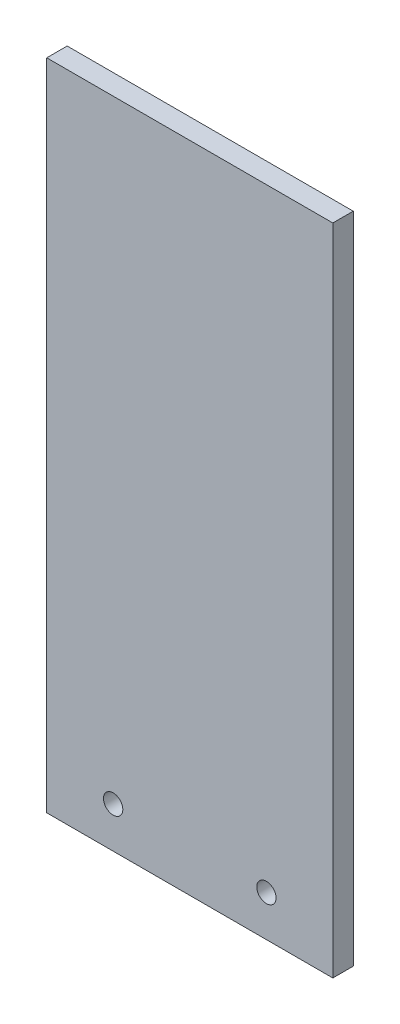
ISO-10303-21;
HEADER;
FILE_DESCRIPTION(('STEP AP214'),'2;1');
FILE_NAME('part.step','',(''),(''),'','','');
FILE_SCHEMA(('AUTOMOTIVE_DESIGN { 1 0 10303 214 1 1 1 1 }'));
ENDSEC;
DATA;
#1=APPLICATION_CONTEXT('core data for automotive mechanical design processes');
#2=APPLICATION_PROTOCOL_DEFINITION('international standard','automotive_design',2000,#1);
#3=PRODUCT_CONTEXT('',#1,'mechanical');
#4=PRODUCT('Part','Part','',(#3));
#5=PRODUCT_RELATED_PRODUCT_CATEGORY('part','',(#4));
#6=PRODUCT_DEFINITION_FORMATION('','',#4);
#7=PRODUCT_DEFINITION_CONTEXT('part definition',#1,'design');
#8=PRODUCT_DEFINITION('design','',#6,#7);
#9=PRODUCT_DEFINITION_SHAPE('','',#8);
#10=(LENGTH_UNIT() NAMED_UNIT(*) SI_UNIT(.MILLI.,.METRE.));
#11=(NAMED_UNIT(*) PLANE_ANGLE_UNIT() SI_UNIT($,.RADIAN.));
#12=(NAMED_UNIT(*) SI_UNIT($,.STERADIAN.) SOLID_ANGLE_UNIT());
#13=UNCERTAINTY_MEASURE_WITH_UNIT(LENGTH_MEASURE(1.E-05),#10,'distance_accuracy_value','');
#14=(GEOMETRIC_REPRESENTATION_CONTEXT(3) GLOBAL_UNCERTAINTY_ASSIGNED_CONTEXT((#13)) GLOBAL_UNIT_ASSIGNED_CONTEXT((#10,
#11,#12)) REPRESENTATION_CONTEXT('',''));
#15=CARTESIAN_POINT('',(0.,0.,0.));
#16=DIRECTION('',(0.,0.,1.));
#17=DIRECTION('',(1.,0.,0.));
#18=AXIS2_PLACEMENT_3D('',#15,#16,#17);
#19=CARTESIAN_POINT('',(0.,203.2,0.));
#20=DIRECTION('',(1.,0.,0.));
#21=DIRECTION('',(0.,0.,-1.));
#22=AXIS2_PLACEMENT_3D('',#19,#20,#21);
#23=PLANE('',#22);
#24=DIRECTION('',(0.,0.,1.));
#25=VECTOR('',#24,1.);
#26=CARTESIAN_POINT('',(0.,0.,0.));
#27=LINE('',#26,#25);
#28=CARTESIAN_POINT('',(0.,0.,-6.35));
#29=VERTEX_POINT('',#28);
#30=CARTESIAN_POINT('',(0.,0.,0.));
#31=VERTEX_POINT('',#30);
#32=EDGE_CURVE('E95',#29,#31,#27,.T.);
#33=ORIENTED_EDGE('',*,*,#32,.T.);
#34=DIRECTION('',(0.,-1.,0.));
#35=VECTOR('',#34,1.);
#36=CARTESIAN_POINT('',(0.,203.2,0.));
#37=LINE('',#36,#35);
#38=CARTESIAN_POINT('',(0.,203.2,0.));
#39=VERTEX_POINT('',#38);
#40=EDGE_CURVE('E11',#39,#31,#37,.T.);
#41=ORIENTED_EDGE('',*,*,#40,.F.);
#42=DIRECTION('',(0.,0.,1.));
#43=VECTOR('',#42,1.);
#44=CARTESIAN_POINT('',(0.,203.2,0.));
#45=LINE('',#44,#43);
#46=CARTESIAN_POINT('',(0.,203.2,-6.35));
#47=VERTEX_POINT('',#46);
#48=EDGE_CURVE('E83',#47,#39,#45,.T.);
#49=ORIENTED_EDGE('',*,*,#48,.F.);
#50=DIRECTION('',(0.,-1.,0.));
#51=VECTOR('',#50,1.);
#52=CARTESIAN_POINT('',(0.,203.2,-6.35));
#53=LINE('',#52,#51);
#54=EDGE_CURVE('E91',#47,#29,#53,.T.);
#55=ORIENTED_EDGE('',*,*,#54,.T.);
#56=EDGE_LOOP('',(#33,#41,#49,#55));
#57=FACE_BOUND('',#56,.T.);
#58=ADVANCED_FACE('F32',(#57),#23,.F.);
#59=CARTESIAN_POINT('',(0.,203.2,0.));
#60=DIRECTION('',(0.,0.,-1.));
#61=DIRECTION('',(-1.,0.,0.));
#62=AXIS2_PLACEMENT_3D('',#59,#60,#61);
#63=PLANE('',#62);
#64=CARTESIAN_POINT('',(20.6375,12.7,0.));
#65=DIRECTION('',(0.,0.,-1.));
#66=DIRECTION('',(-1.,0.,0.));
#67=AXIS2_PLACEMENT_3D('',#64,#65,#66);
#68=CIRCLE('',#67,3.);
#69=CARTESIAN_POINT('',(17.6375,12.7,0.));
#70=VERTEX_POINT('',#69);
#71=EDGE_CURVE('E114',#70,#70,#68,.T.);
#72=ORIENTED_EDGE('',*,*,#71,.T.);
#73=EDGE_LOOP('',(#72));
#74=FACE_BOUND('',#73,.T.);
#75=CARTESIAN_POINT('',(68.2625,12.7,0.));
#76=DIRECTION('',(0.,0.,-1.));
#77=DIRECTION('',(-1.,0.,0.));
#78=AXIS2_PLACEMENT_3D('',#75,#76,#77);
#79=CIRCLE('',#78,3.);
#80=CARTESIAN_POINT('',(65.2625,12.7,0.));
#81=VERTEX_POINT('',#80);
#82=EDGE_CURVE('E98',#81,#81,#79,.T.);
#83=ORIENTED_EDGE('',*,*,#82,.T.);
#84=EDGE_LOOP('',(#83));
#85=FACE_BOUND('',#84,.T.);
#86=DIRECTION('',(1.,0.,0.));
#87=VECTOR('',#86,1.);
#88=CARTESIAN_POINT('',(0.,0.,0.));
#89=LINE('',#88,#87);
#90=CARTESIAN_POINT('',(88.9,0.,0.));
#91=VERTEX_POINT('',#90);
#92=EDGE_CURVE('E87',#31,#91,#89,.T.);
#93=ORIENTED_EDGE('',*,*,#92,.T.);
#94=DIRECTION('',(0.,-1.,0.));
#95=VECTOR('',#94,1.);
#96=CARTESIAN_POINT('',(88.9,203.2,0.));
#97=LINE('',#96,#95);
#98=CARTESIAN_POINT('',(88.9,203.2,0.));
#99=VERTEX_POINT('',#98);
#100=EDGE_CURVE('E40',#99,#91,#97,.T.);
#101=ORIENTED_EDGE('',*,*,#100,.F.);
#102=DIRECTION('',(1.,0.,0.));
#103=VECTOR('',#102,1.);
#104=CARTESIAN_POINT('',(0.,203.2,0.));
#105=LINE('',#104,#103);
#106=EDGE_CURVE('E78',#39,#99,#105,.T.);
#107=ORIENTED_EDGE('',*,*,#106,.F.);
#108=ORIENTED_EDGE('',*,*,#40,.T.);
#109=EDGE_LOOP('',(#93,#101,#107,#108));
#110=FACE_BOUND('',#109,.T.);
#111=ADVANCED_FACE('F86',(#74,#85,#110),#63,.F.);
#112=CARTESIAN_POINT('',(88.9,203.2,0.));
#113=DIRECTION('',(-1.,0.,0.));
#114=DIRECTION('',(0.,0.,1.));
#115=AXIS2_PLACEMENT_3D('',#112,#113,#114);
#116=PLANE('',#115);
#117=DIRECTION('',(0.,0.,-1.));
#118=VECTOR('',#117,1.);
#119=CARTESIAN_POINT('',(88.9,0.,0.));
#120=LINE('',#119,#118);
#121=CARTESIAN_POINT('',(88.9,0.,-6.35));
#122=VERTEX_POINT('',#121);
#123=EDGE_CURVE('E65',#91,#122,#120,.T.);
#124=ORIENTED_EDGE('',*,*,#123,.T.);
#125=DIRECTION('',(0.,-1.,0.));
#126=VECTOR('',#125,1.);
#127=CARTESIAN_POINT('',(88.9,203.2,-6.35));
#128=LINE('',#127,#126);
#129=CARTESIAN_POINT('',(88.9,203.2,-6.35));
#130=VERTEX_POINT('',#129);
#131=EDGE_CURVE('E88',#130,#122,#128,.T.);
#132=ORIENTED_EDGE('',*,*,#131,.F.);
#133=DIRECTION('',(0.,0.,-1.));
#134=VECTOR('',#133,1.);
#135=CARTESIAN_POINT('',(88.9,203.2,0.));
#136=LINE('',#135,#134);
#137=EDGE_CURVE('E81',#99,#130,#136,.T.);
#138=ORIENTED_EDGE('',*,*,#137,.F.);
#139=ORIENTED_EDGE('',*,*,#100,.T.);
#140=EDGE_LOOP('',(#124,#132,#138,#139));
#141=FACE_BOUND('',#140,.T.);
#142=ADVANCED_FACE('F89',(#141),#116,.F.);
#143=CARTESIAN_POINT('',(0.,203.2,-6.35));
#144=DIRECTION('',(0.,0.,1.));
#145=DIRECTION('',(1.,0.,0.));
#146=AXIS2_PLACEMENT_3D('',#143,#144,#145);
#147=PLANE('',#146);
#148=CARTESIAN_POINT('',(20.6375,12.7,-6.35));
#149=DIRECTION('',(0.,0.,-1.));
#150=DIRECTION('',(-1.,0.,0.));
#151=AXIS2_PLACEMENT_3D('',#148,#149,#150);
#152=CIRCLE('',#151,3.);
#153=CARTESIAN_POINT('',(17.6375,12.7,-6.35));
#154=VERTEX_POINT('',#153);
#155=EDGE_CURVE('E117',#154,#154,#152,.T.);
#156=ORIENTED_EDGE('',*,*,#155,.F.);
#157=EDGE_LOOP('',(#156));
#158=FACE_BOUND('',#157,.T.);
#159=CARTESIAN_POINT('',(68.2625,12.7,-6.35));
#160=DIRECTION('',(0.,0.,-1.));
#161=DIRECTION('',(-1.,0.,0.));
#162=AXIS2_PLACEMENT_3D('',#159,#160,#161);
#163=CIRCLE('',#162,3.);
#164=CARTESIAN_POINT('',(65.2625,12.7,-6.35));
#165=VERTEX_POINT('',#164);
#166=EDGE_CURVE('E111',#165,#165,#163,.T.);
#167=ORIENTED_EDGE('',*,*,#166,.F.);
#168=EDGE_LOOP('',(#167));
#169=FACE_BOUND('',#168,.T.);
#170=DIRECTION('',(-1.,0.,0.));
#171=VECTOR('',#170,1.);
#172=CARTESIAN_POINT('',(0.,0.,-6.35));
#173=LINE('',#172,#171);
#174=EDGE_CURVE('E71',#122,#29,#173,.T.);
#175=ORIENTED_EDGE('',*,*,#174,.T.);
#176=ORIENTED_EDGE('',*,*,#54,.F.);
#177=DIRECTION('',(-1.,0.,0.));
#178=VECTOR('',#177,1.);
#179=CARTESIAN_POINT('',(0.,203.2,-6.35));
#180=LINE('',#179,#178);
#181=EDGE_CURVE('E48',#130,#47,#180,.T.);
#182=ORIENTED_EDGE('',*,*,#181,.F.);
#183=ORIENTED_EDGE('',*,*,#131,.T.);
#184=EDGE_LOOP('',(#175,#176,#182,#183));
#185=FACE_BOUND('',#184,.T.);
#186=ADVANCED_FACE('F103',(#158,#169,#185),#147,.F.);
#187=CARTESIAN_POINT('',(0.,203.2,0.));
#188=DIRECTION('',(0.,-1.,0.));
#189=DIRECTION('',(0.,0.,-1.));
#190=AXIS2_PLACEMENT_3D('',#187,#188,#189);
#191=PLANE('',#190);
#192=ORIENTED_EDGE('',*,*,#48,.T.);
#193=ORIENTED_EDGE('',*,*,#106,.T.);
#194=ORIENTED_EDGE('',*,*,#137,.T.);
#195=ORIENTED_EDGE('',*,*,#181,.T.);
#196=EDGE_LOOP('',(#192,#193,#194,#195));
#197=FACE_BOUND('',#196,.T.);
#198=ADVANCED_FACE('F79',(#197),#191,.F.);
#199=CARTESIAN_POINT('',(0.,0.,0.));
#200=DIRECTION('',(0.,-1.,0.));
#201=DIRECTION('',(0.,0.,-1.));
#202=AXIS2_PLACEMENT_3D('',#199,#200,#201);
#203=PLANE('',#202);
#204=ORIENTED_EDGE('',*,*,#32,.F.);
#205=ORIENTED_EDGE('',*,*,#174,.F.);
#206=ORIENTED_EDGE('',*,*,#123,.F.);
#207=ORIENTED_EDGE('',*,*,#92,.F.);
#208=EDGE_LOOP('',(#204,#205,#206,#207));
#209=FACE_BOUND('',#208,.T.);
#210=ADVANCED_FACE('F106',(#209),#203,.T.);
#211=CARTESIAN_POINT('',(68.2625,12.7,-6.35));
#212=DIRECTION('',(0.,0.,-1.));
#213=DIRECTION('',(-1.,0.,0.));
#214=AXIS2_PLACEMENT_3D('',#211,#212,#213);
#215=CYLINDRICAL_SURFACE('',#214,3.);
#216=ORIENTED_EDGE('',*,*,#82,.F.);
#217=EDGE_LOOP('',(#216));
#218=FACE_BOUND('',#217,.T.);
#219=ORIENTED_EDGE('',*,*,#166,.T.);
#220=EDGE_LOOP('',(#219));
#221=FACE_BOUND('',#220,.T.);
#222=ADVANCED_FACE('F128',(#218,#221),#215,.F.);
#223=CARTESIAN_POINT('',(20.6375,12.7,-6.35));
#224=DIRECTION('',(0.,0.,-1.));
#225=DIRECTION('',(-1.,0.,0.));
#226=AXIS2_PLACEMENT_3D('',#223,#224,#225);
#227=CYLINDRICAL_SURFACE('',#226,3.);
#228=ORIENTED_EDGE('',*,*,#71,.F.);
#229=EDGE_LOOP('',(#228));
#230=FACE_BOUND('',#229,.T.);
#231=ORIENTED_EDGE('',*,*,#155,.T.);
#232=EDGE_LOOP('',(#231));
#233=FACE_BOUND('',#232,.T.);
#234=ADVANCED_FACE('F121',(#230,#233),#227,.F.);
#235=CLOSED_SHELL('',(#58,#111,#142,#186,#198,#210,#222,#234));
#236=MANIFOLD_SOLID_BREP('B2',#235);
#237=ADVANCED_BREP_SHAPE_REPRESENTATION('',(#18,#236),#14);
#238=SHAPE_DEFINITION_REPRESENTATION(#9,#237);
ENDSEC;
END-ISO-10303-21;
